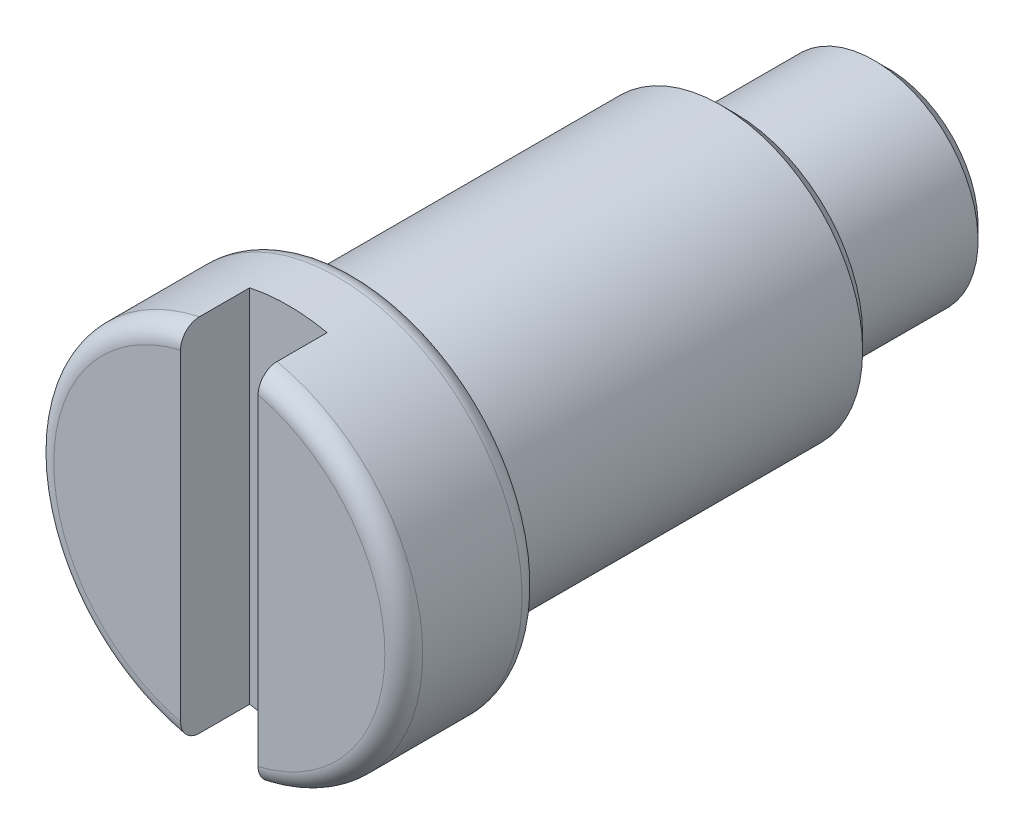
ISO-10303-21;
HEADER;
FILE_DESCRIPTION(('STEP AP214'),'2;1');
FILE_NAME('part.step','',(''),(''),'','','');
FILE_SCHEMA(('AUTOMOTIVE_DESIGN { 1 0 10303 214 1 1 1 1 }'));
ENDSEC;
DATA;
#1=APPLICATION_CONTEXT('core data for automotive mechanical design processes');
#2=APPLICATION_PROTOCOL_DEFINITION('international standard','automotive_design',2000,#1);
#3=PRODUCT_CONTEXT('',#1,'mechanical');
#4=PRODUCT('Part','Part','',(#3));
#5=PRODUCT_RELATED_PRODUCT_CATEGORY('part','',(#4));
#6=PRODUCT_DEFINITION_FORMATION('','',#4);
#7=PRODUCT_DEFINITION_CONTEXT('part definition',#1,'design');
#8=PRODUCT_DEFINITION('design','',#6,#7);
#9=PRODUCT_DEFINITION_SHAPE('','',#8);
#10=(LENGTH_UNIT() NAMED_UNIT(*) SI_UNIT(.MILLI.,.METRE.));
#11=(NAMED_UNIT(*) PLANE_ANGLE_UNIT() SI_UNIT($,.RADIAN.));
#12=(NAMED_UNIT(*) SI_UNIT($,.STERADIAN.) SOLID_ANGLE_UNIT());
#13=UNCERTAINTY_MEASURE_WITH_UNIT(LENGTH_MEASURE(1.E-05),#10,'distance_accuracy_value','');
#14=(GEOMETRIC_REPRESENTATION_CONTEXT(3) GLOBAL_UNCERTAINTY_ASSIGNED_CONTEXT((#13)) GLOBAL_UNIT_ASSIGNED_CONTEXT((#10,
#11,#12)) REPRESENTATION_CONTEXT('',''));
#15=CARTESIAN_POINT('',(0.,0.,0.));
#16=DIRECTION('',(0.,0.,1.));
#17=DIRECTION('',(1.,0.,0.));
#18=AXIS2_PLACEMENT_3D('',#15,#16,#17);
#19=CARTESIAN_POINT('',(-0.41,-8.96687794051,-0.73));
#20=DIRECTION('',(0.,0.,1.));
#21=DIRECTION('',(1.,0.,0.));
#22=AXIS2_PLACEMENT_3D('',#19,#20,#21);
#23=PLANE('',#22);
#24=CARTESIAN_POINT('',(0.,0.,-0.73));
#25=DIRECTION('',(0.,0.,-1.));
#26=DIRECTION('',(-1.,0.,0.));
#27=AXIS2_PLACEMENT_3D('',#24,#25,#26);
#28=CIRCLE('',#27,1.95);
#29=CARTESIAN_POINT('',(0.41,1.9064102391754,-0.73));
#30=VERTEX_POINT('',#29);
#31=CARTESIAN_POINT('',(-0.41,1.9064102391669,-0.73));
#32=VERTEX_POINT('',#31);
#33=EDGE_CURVE('E80',#30,#32,#28,.F.);
#34=ORIENTED_EDGE('',*,*,#33,.T.);
#35=DIRECTION('',(0.,1.,0.));
#36=VECTOR('',#35,1.);
#37=CARTESIAN_POINT('',(-0.41,-8.96687794051,-0.73));
#38=LINE('',#37,#36);
#39=CARTESIAN_POINT('',(-0.41,-1.9064102391669,-0.73));
#40=VERTEX_POINT('',#39);
#41=EDGE_CURVE('E82',#40,#32,#38,.T.);
#42=ORIENTED_EDGE('',*,*,#41,.F.);
#43=CARTESIAN_POINT('',(0.,0.,-0.73));
#44=DIRECTION('',(0.,0.,-1.));
#45=DIRECTION('',(-1.,0.,0.));
#46=AXIS2_PLACEMENT_3D('',#43,#44,#45);
#47=CIRCLE('',#46,1.95);
#48=CARTESIAN_POINT('',(0.41,-1.9064102391669,-0.73));
#49=VERTEX_POINT('',#48);
#50=EDGE_CURVE('E20',#40,#49,#47,.F.);
#51=ORIENTED_EDGE('',*,*,#50,.T.);
#52=DIRECTION('',(0.,1.,0.));
#53=VECTOR('',#52,1.);
#54=CARTESIAN_POINT('',(0.41,-8.96687794051,-0.73));
#55=LINE('',#54,#53);
#56=EDGE_CURVE('E89',#30,#49,#55,.F.);
#57=ORIENTED_EDGE('',*,*,#56,.F.);
#58=EDGE_LOOP('',(#34,#42,#51,#57));
#59=FACE_BOUND('',#58,.T.);
#60=ADVANCED_FACE('F17',(#59),#23,.T.);
#61=CARTESIAN_POINT('',(0.41,-8.96687794051,-0.73));
#62=DIRECTION('',(-1.,0.,0.));
#63=DIRECTION('',(0.,0.,1.));
#64=AXIS2_PLACEMENT_3D('',#61,#62,#63);
#65=PLANE('',#64);
#66=DIRECTION('',(0.,0.,1.));
#67=VECTOR('',#66,1.);
#68=CARTESIAN_POINT('',(0.41,1.906410239184,-0.73));
#69=LINE('',#68,#67);
#70=CARTESIAN_POINT('',(0.41,1.9064102391754,-0.199999999997));
#71=VERTEX_POINT('',#70);
#72=EDGE_CURVE('E91',#71,#30,#69,.F.);
#73=ORIENTED_EDGE('',*,*,#72,.T.);
#74=ORIENTED_EDGE('',*,*,#56,.T.);
#75=DIRECTION('',(0.,0.,1.));
#76=VECTOR('',#75,1.);
#77=CARTESIAN_POINT('',(0.41,-1.906410239167,-0.73));
#78=LINE('',#77,#76);
#79=CARTESIAN_POINT('',(0.409999999999999,-1.9064102391669,-0.1999999999982));
#80=VERTEX_POINT('',#79);
#81=EDGE_CURVE('E76',#49,#80,#78,.T.);
#82=ORIENTED_EDGE('',*,*,#81,.T.);
#83=CARTESIAN_POINT('',(0.409999999999999,-1.9064102391668,-0.1999999999994));
#84=CARTESIAN_POINT('',(0.410000000000001,-1.90642073201662,-0.188935909425886));
#85=CARTESIAN_POINT('',(0.41,-1.90547181301739,-0.17787601446626));
#86=CARTESIAN_POINT('',(0.409999999999999,-1.90173416208713,-0.156086634893258));
#87=CARTESIAN_POINT('',(0.409999999999998,-1.89894796519605,-0.14535671630541));
#88=CARTESIAN_POINT('',(0.409999999999998,-1.89161334067293,-0.12451421506964));
#89=CARTESIAN_POINT('',(0.409999999999999,-1.88706441660261,-0.11440180726134));
#90=CARTESIAN_POINT('',(0.41,-1.87634918228616,-0.095075278442462));
#91=CARTESIAN_POINT('',(0.409999999999999,-1.87018289207332,-0.0858611463074552));
#92=CARTESIAN_POINT('',(0.409999999999999,-1.85635504906559,-0.0684963080743695));
#93=CARTESIAN_POINT('',(0.41,-1.84868044255964,-0.0603560043149509));
#94=CARTESIAN_POINT('',(0.409999999999999,-1.83209823806731,-0.0454459635773487));
#95=CARTESIAN_POINT('',(0.409999999999998,-1.82319043083293,-0.0386764596758893));
#96=CARTESIAN_POINT('',(0.409999999999998,-1.80419297936883,-0.0265439694319283));
#97=CARTESIAN_POINT('',(0.409999999999999,-1.79408202654268,-0.0212143879963644));
#98=CARTESIAN_POINT('',(0.41,-1.77312406597645,-0.012284540769646));
#99=CARTESIAN_POINT('',(0.409999999999999,-1.76227719565737,-0.00868395312492724));
#100=CARTESIAN_POINT('',(0.409999999999999,-1.74304683526872,-0.00399599964380329));
#101=CARTESIAN_POINT('',(0.409999999999999,-1.73476082665802,-0.00249765790653519));
#102=CARTESIAN_POINT('',(0.41,-1.71808183905436,-0.000499679376716791));
#103=CARTESIAN_POINT('',(0.410000000000001,-1.70968903928075,1.45300888987605E-06));
#104=CARTESIAN_POINT('',(0.410000000000001,-1.70129362545099,0.));
#105=B_SPLINE_CURVE_WITH_KNOTS('',3,(#83,#84,#85,#86,#87,#88,#89,#90,#91,#92,#93,#94,#95,#96,
#97,#98,#99,#100,#101,#102,#103,#104),.UNSPECIFIED.,.F.,.F.,(4,2,2,2,2,2,2,2,2,2,4),(0.,
0.0331453845891454,0.0662451312529841,0.0993542066082952,0.132462871881988,0.165871807589145,
0.199286419047546,0.233420144854118,0.267547514175047,0.292751405910464,0.317917468817511),.UNSPECIFIED.);
#106=CARTESIAN_POINT('',(0.41,-1.701293625451,0.));
#107=VERTEX_POINT('',#106);
#108=EDGE_CURVE('E99',#80,#107,#105,.T.);
#109=ORIENTED_EDGE('',*,*,#108,.T.);
#110=DIRECTION('',(0.,1.,0.));
#111=VECTOR('',#110,1.);
#112=CARTESIAN_POINT('',(0.41,0.,0.));
#113=LINE('',#112,#111);
#114=CARTESIAN_POINT('',(0.41,1.701293625451,0.));
#115=VERTEX_POINT('',#114);
#116=EDGE_CURVE('E119',#107,#115,#113,.T.);
#117=ORIENTED_EDGE('',*,*,#116,.T.);
#118=CARTESIAN_POINT('',(0.409999999999999,1.701293625451,0.));
#119=CARTESIAN_POINT('',(0.410000000002229,1.71306590904861,8.78214871465354E-06));
#120=CARTESIAN_POINT('',(0.410000000001304,1.7248381977497,-0.000981901612816971));
#121=CARTESIAN_POINT('',(0.409999999998695,1.74805561338932,-0.00490756838201299));
#122=CARTESIAN_POINT('',(0.409999999997009,1.75950069623836,-0.00784281213418027));
#123=CARTESIAN_POINT('',(0.409999999998427,1.78174299074401,-0.0156063587050561));
#124=CARTESIAN_POINT('',(0.410000000001535,1.79253962254991,-0.0204363275759226));
#125=CARTESIAN_POINT('',(0.409999999998465,1.81314685306385,-0.0318657093925813));
#126=CARTESIAN_POINT('',(0.409999999992293,1.82295790720166,-0.0384642998495639));
#127=CARTESIAN_POINT('',(0.409999999993566,1.84115406576136,-0.0531454088814542));
#128=CARTESIAN_POINT('',(0.410000000000806,1.84955854059986,-0.0612039028652662));
#129=CARTESIAN_POINT('',(0.409999999999194,1.86485290917502,-0.0786481254288913));
#130=CARTESIAN_POINT('',(0.409999999990345,1.87174315662201,-0.0880335432073086));
#131=CARTESIAN_POINT('',(0.409999999989569,1.88363996534004,-0.107622254778722));
#132=CARTESIAN_POINT('',(0.409999999997243,1.88868763260167,-0.117800622631082));
#133=CARTESIAN_POINT('',(0.410000000002754,1.89695967352409,-0.138868589182004));
#134=CARTESIAN_POINT('',(0.410000000000601,1.90018573741462,-0.149757518062343));
#135=CARTESIAN_POINT('',(0.40999999999965,1.90376613264431,-0.167279422370648));
#136=CARTESIAN_POINT('',(0.409999999999825,1.90475718075972,-0.173788735975535));
#137=CARTESIAN_POINT('',(0.410000000000174,1.90607898727918,-0.186864323551235));
#138=CARTESIAN_POINT('',(0.410000000000346,1.90641071913279,-0.193430499149179));
#139=CARTESIAN_POINT('',(0.409999999999992,1.9064102391668,-0.199999999998196));
#140=B_SPLINE_CURVE_WITH_KNOTS('',3,(#118,#119,#120,#121,#122,#123,#124,#125,#126,#127,#128,
#129,#130,#131,#132,#133,#134,#135,#136,#137,#138,#139),.UNSPECIFIED.,.F.,.F.,(4,2,2,2,2,2,2,2,
2,2,4),(0.,0.0352756157378741,0.0705559625126531,0.105867401464157,0.141162447410486,
0.175922174914147,0.210673774197639,0.244594325750203,0.278483351153767,0.298206112665351,
0.317899732747287),.UNSPECIFIED.);
#141=EDGE_CURVE('E98',#115,#71,#140,.T.);
#142=ORIENTED_EDGE('',*,*,#141,.T.);
#143=EDGE_LOOP('',(#73,#74,#82,#109,#117,#142));
#144=FACE_BOUND('',#143,.T.);
#145=ADVANCED_FACE('F387',(#144),#65,.T.);
#146=CARTESIAN_POINT('',(-0.41,-8.96687794051,0.));
#147=DIRECTION('',(1.,0.,0.));
#148=DIRECTION('',(0.,0.,-1.));
#149=AXIS2_PLACEMENT_3D('',#146,#147,#148);
#150=PLANE('',#149);
#151=DIRECTION('',(0.,1.,0.));
#152=VECTOR('',#151,1.);
#153=CARTESIAN_POINT('',(-0.41,0.,0.));
#154=LINE('',#153,#152);
#155=CARTESIAN_POINT('',(-0.41,1.701293625451,0.));
#156=VERTEX_POINT('',#155);
#157=CARTESIAN_POINT('',(-0.41,-1.701293625451,0.));
#158=VERTEX_POINT('',#157);
#159=EDGE_CURVE('E117',#156,#158,#154,.F.);
#160=ORIENTED_EDGE('',*,*,#159,.T.);
#161=CARTESIAN_POINT('',(-0.41,-1.701293625451,0.));
#162=CARTESIAN_POINT('',(-0.41000000000223,-1.71306590904861,8.78214871464386E-06));
#163=CARTESIAN_POINT('',(-0.410000000001305,-1.7248381977497,-0.000981901612817001));
#164=CARTESIAN_POINT('',(-0.409999999998695,-1.74805561338932,-0.00490756838201304));
#165=CARTESIAN_POINT('',(-0.409999999997009,-1.75950069623836,-0.00784281213418028));
#166=CARTESIAN_POINT('',(-0.409999999998427,-1.78174299074401,-0.015606358705056));
#167=CARTESIAN_POINT('',(-0.410000000001535,-1.79253962254991,-0.0204363275759224));
#168=CARTESIAN_POINT('',(-0.409999999998466,-1.81314685306385,-0.0318657093925812));
#169=CARTESIAN_POINT('',(-0.409999999992294,-1.82295790720166,-0.038464299849564));
#170=CARTESIAN_POINT('',(-0.409999999993567,-1.84115406576136,-0.0531454088814543));
#171=CARTESIAN_POINT('',(-0.410000000000806,-1.84955854059986,-0.0612039028652663));
#172=CARTESIAN_POINT('',(-0.409999999999194,-1.86485290917502,-0.0786481254288913));
#173=CARTESIAN_POINT('',(-0.409999999990345,-1.87174315662201,-0.0880335432073086));
#174=CARTESIAN_POINT('',(-0.40999999998957,-1.88363996534004,-0.107622254778722));
#175=CARTESIAN_POINT('',(-0.409999999997244,-1.88868763260167,-0.117800622631081));
#176=CARTESIAN_POINT('',(-0.410000000002754,-1.89695967352409,-0.138868589182003));
#177=CARTESIAN_POINT('',(-0.410000000000599,-1.90018573741462,-0.149757518062343));
#178=CARTESIAN_POINT('',(-0.409999999999648,-1.90376613264437,-0.167279422370942));
#179=CARTESIAN_POINT('',(-0.409999999999825,-1.90475718075981,-0.173788735976129));
#180=CARTESIAN_POINT('',(-0.410000000000175,-1.90607898727927,-0.186864323552431));
#181=CARTESIAN_POINT('',(-0.410000000000348,-1.90641071913285,-0.193430499150679));
#182=CARTESIAN_POINT('',(-0.409999999999993,-1.9064102391668,-0.199999999999996));
#183=B_SPLINE_CURVE_WITH_KNOTS('',3,(#161,#162,#163,#164,#165,#166,#167,#168,#169,#170,#171,
#172,#173,#174,#175,#176,#177,#178,#179,#180,#181,#182),.UNSPECIFIED.,.F.,.F.,(4,2,2,2,2,2,2,2,
2,2,4),(0.,0.0352756157378745,0.0705559625126533,0.105867401464157,0.141162447410486,
0.175922174914147,0.210673774197639,0.244594325750202,0.278483351153768,0.29820611266625,
0.317899732749085),.UNSPECIFIED.);
#184=CARTESIAN_POINT('',(-0.41,-1.9064102391669,-0.2));
#185=VERTEX_POINT('',#184);
#186=EDGE_CURVE('E35',#158,#185,#183,.T.);
#187=ORIENTED_EDGE('',*,*,#186,.T.);
#188=DIRECTION('',(0.,0.,-1.));
#189=VECTOR('',#188,1.);
#190=CARTESIAN_POINT('',(-0.41,-1.906410239167,0.));
#191=LINE('',#190,#189);
#192=EDGE_CURVE('E73',#185,#40,#191,.T.);
#193=ORIENTED_EDGE('',*,*,#192,.T.);
#194=ORIENTED_EDGE('',*,*,#41,.T.);
#195=DIRECTION('',(0.,0.,-1.));
#196=VECTOR('',#195,1.);
#197=CARTESIAN_POINT('',(-0.41,1.906410239167,0.));
#198=LINE('',#197,#196);
#199=CARTESIAN_POINT('',(-0.41,1.9064102391669,-0.2));
#200=VERTEX_POINT('',#199);
#201=EDGE_CURVE('E86',#32,#200,#198,.F.);
#202=ORIENTED_EDGE('',*,*,#201,.T.);
#203=CARTESIAN_POINT('',(-0.41,1.9064102391668,-0.2));
#204=CARTESIAN_POINT('',(-0.41,1.90642073201665,-0.188935909426487));
#205=CARTESIAN_POINT('',(-0.41,1.90547181301746,-0.177876014466859));
#206=CARTESIAN_POINT('',(-0.41,1.90173416208727,-0.156086634893848));
#207=CARTESIAN_POINT('',(-0.41,1.89894796519622,-0.145356716305992));
#208=CARTESIAN_POINT('',(-0.41,1.89161334067317,-0.124514215070201));
#209=CARTESIAN_POINT('',(-0.41,1.88706441660288,-0.114401807261888));
#210=CARTESIAN_POINT('',(-0.41,1.87634918228649,-0.0950752784429788));
#211=CARTESIAN_POINT('',(-0.409999999999999,1.87018289207367,-0.085861146307954));
#212=CARTESIAN_POINT('',(-0.41,1.856355049066,-0.0684963080748281));
#213=CARTESIAN_POINT('',(-0.41,1.84868044256008,-0.0603560043153873));
#214=CARTESIAN_POINT('',(-0.41,1.83209823806779,-0.045445963577737));
#215=CARTESIAN_POINT('',(-0.41,1.82319043083343,-0.0386764596762518));
#216=CARTESIAN_POINT('',(-0.409999999999999,1.80419297936938,-0.0265439694322356));
#217=CARTESIAN_POINT('',(-0.41,1.79408202654325,-0.0212143879966421));
#218=CARTESIAN_POINT('',(-0.41,1.77312406597704,-0.012284540769862));
#219=CARTESIAN_POINT('',(-0.41,1.76227719565798,-0.00868395312511121));
#220=CARTESIAN_POINT('',(-0.41,1.74304683526924,-0.00399599964390427));
#221=CARTESIAN_POINT('',(-0.41,1.73476082665844,-0.00249765790659835));
#222=CARTESIAN_POINT('',(-0.41,1.71808183905457,-0.000499679376729377));
#223=CARTESIAN_POINT('',(-0.41,1.70968903928086,1.45300889005112E-06));
#224=CARTESIAN_POINT('',(-0.410000000000001,1.70129362545099,0.));
#225=B_SPLINE_CURVE_WITH_KNOTS('',3,(#203,#204,#205,#206,#207,#208,#209,#210,#211,#212,#213,
#214,#215,#216,#217,#218,#219,#220,#221,#222,#223,#224),.UNSPECIFIED.,.F.,.F.,(4,2,2,2,2,2,2,2,
2,2,4),(0.,0.0331453845891425,0.0662451312529782,0.0993542066082864,0.132462871881977,
0.165871807589129,0.199286419047523,0.233420144854088,0.26754751417501,0.292751405910745,
0.31791746881811),.UNSPECIFIED.);
#226=EDGE_CURVE('E120',#200,#156,#225,.T.);
#227=ORIENTED_EDGE('',*,*,#226,.T.);
#228=EDGE_LOOP('',(#160,#187,#193,#194,#202,#227));
#229=FACE_BOUND('',#228,.T.);
#230=ADVANCED_FACE('F88',(#229),#150,.T.);
#231=CARTESIAN_POINT('',(0.,0.,-7.07));
#232=DIRECTION('',(0.,0.,-1.));
#233=DIRECTION('',(-1.,0.,0.));
#234=AXIS2_PLACEMENT_3D('',#231,#232,#233);
#235=PLANE('',#234);
#236=CARTESIAN_POINT('',(0.,0.,-7.06999999994196));
#237=DIRECTION('',(0.,0.,1.));
#238=DIRECTION('',(0.,-1.,0.));
#239=AXIS2_PLACEMENT_3D('',#236,#237,#238);
#240=CIRCLE('',#239,0.950000000045748);
#241=CARTESIAN_POINT('',(0.,-0.950000000045747,-7.06999999994196));
#242=VERTEX_POINT('',#241);
#243=EDGE_CURVE('E113',#242,#242,#240,.T.);
#244=ORIENTED_EDGE('',*,*,#243,.F.);
#245=EDGE_LOOP('',(#244));
#246=FACE_BOUND('',#245,.T.);
#247=ADVANCED_FACE('F176',(#246),#235,.T.);
#248=CARTESIAN_POINT('',(0.,0.,0.));
#249=DIRECTION('',(0.,0.,-1.));
#250=DIRECTION('',(-1.,0.,0.));
#251=AXIS2_PLACEMENT_3D('',#248,#249,#250);
#252=PLANE('',#251);
#253=ORIENTED_EDGE('',*,*,#116,.F.);
#254=CARTESIAN_POINT('',(0.,0.,0.));
#255=DIRECTION('',(0.,0.,-1.));
#256=DIRECTION('',(0.234285714285706,0.972167785971967,0.));
#257=AXIS2_PLACEMENT_3D('',#254,#255,#256);
#258=CIRCLE('',#257,1.75000000000006);
#259=EDGE_CURVE('E116',#115,#107,#258,.T.);
#260=ORIENTED_EDGE('',*,*,#259,.F.);
#261=EDGE_LOOP('',(#253,#260));
#262=FACE_BOUND('',#261,.T.);
#263=ADVANCED_FACE('F173',(#262),#252,.F.);
#264=CARTESIAN_POINT('',(0.,0.,0.));
#265=DIRECTION('',(0.,0.,-1.));
#266=DIRECTION('',(-1.,0.,0.));
#267=AXIS2_PLACEMENT_3D('',#264,#265,#266);
#268=PLANE('',#267);
#269=CARTESIAN_POINT('',(0.,0.,0.));
#270=DIRECTION('',(0.,0.,-1.));
#271=DIRECTION('',(-0.234285714285706,-0.972167785971967,0.));
#272=AXIS2_PLACEMENT_3D('',#269,#270,#271);
#273=CIRCLE('',#272,1.75000000000006);
#274=EDGE_CURVE('E157',#158,#156,#273,.T.);
#275=ORIENTED_EDGE('',*,*,#274,.F.);
#276=ORIENTED_EDGE('',*,*,#159,.F.);
#277=EDGE_LOOP('',(#275,#276));
#278=FACE_BOUND('',#277,.T.);
#279=ADVANCED_FACE('F163',(#278),#268,.F.);
#280=CARTESIAN_POINT('',(0.,0.,-6.91999999997961));
#281=DIRECTION('',(0.,0.,1.));
#282=DIRECTION('',(0.,-1.,0.));
#283=AXIS2_PLACEMENT_3D('',#280,#281,#282);
#284=CONICAL_SURFACE('',#283,1.10000000000809,0.785398163397448);
#285=ORIENTED_EDGE('',*,*,#243,.T.);
#286=EDGE_LOOP('',(#285));
#287=FACE_BOUND('',#286,.T.);
#288=CARTESIAN_POINT('',(0.,0.,-6.92));
#289=DIRECTION('',(0.,0.,-1.));
#290=DIRECTION('',(-1.,0.,0.));
#291=AXIS2_PLACEMENT_3D('',#288,#289,#290);
#292=CIRCLE('',#291,1.1);
#293=CARTESIAN_POINT('',(-1.1,0.,-6.92));
#294=VERTEX_POINT('',#293);
#295=EDGE_CURVE('E112',#294,#294,#292,.F.);
#296=ORIENTED_EDGE('',*,*,#295,.F.);
#297=EDGE_LOOP('',(#296));
#298=FACE_BOUND('',#297,.T.);
#299=ADVANCED_FACE('F172',(#287,#298),#284,.T.);
#300=CARTESIAN_POINT('',(0.,0.,-0.2));
#301=DIRECTION('',(0.,0.,-1.));
#302=DIRECTION('',(-1.,0.,0.));
#303=AXIS2_PLACEMENT_3D('',#300,#301,#302);
#304=TOROIDAL_SURFACE('',#303,1.75,0.2);
#305=ORIENTED_EDGE('',*,*,#108,.F.);
#306=CARTESIAN_POINT('',(0.,0.,-0.199999999997));
#307=DIRECTION('',(0.,0.,-1.));
#308=DIRECTION('',(-1.,0.,0.));
#309=AXIS2_PLACEMENT_3D('',#306,#307,#308);
#310=CIRCLE('',#309,1.95);
#311=EDGE_CURVE('E110',#71,#80,#310,.T.);
#312=ORIENTED_EDGE('',*,*,#311,.F.);
#313=ORIENTED_EDGE('',*,*,#141,.F.);
#314=ORIENTED_EDGE('',*,*,#259,.T.);
#315=EDGE_LOOP('',(#305,#312,#313,#314));
#316=FACE_BOUND('',#315,.T.);
#317=ADVANCED_FACE('F139',(#316),#304,.T.);
#318=CARTESIAN_POINT('',(0.,0.,-0.2));
#319=DIRECTION('',(0.,0.,-1.));
#320=DIRECTION('',(-1.,0.,0.));
#321=AXIS2_PLACEMENT_3D('',#318,#319,#320);
#322=TOROIDAL_SURFACE('',#321,1.75,0.2);
#323=ORIENTED_EDGE('',*,*,#186,.F.);
#324=ORIENTED_EDGE('',*,*,#274,.T.);
#325=ORIENTED_EDGE('',*,*,#226,.F.);
#326=CARTESIAN_POINT('',(0.,0.,-0.2));
#327=DIRECTION('',(0.,0.,-1.));
#328=DIRECTION('',(-1.,0.,0.));
#329=AXIS2_PLACEMENT_3D('',#326,#327,#328);
#330=CIRCLE('',#329,1.95);
#331=EDGE_CURVE('E109',#185,#200,#330,.T.);
#332=ORIENTED_EDGE('',*,*,#331,.F.);
#333=EDGE_LOOP('',(#323,#324,#325,#332));
#334=FACE_BOUND('',#333,.T.);
#335=ADVANCED_FACE('F132',(#334),#322,.T.);
#336=CARTESIAN_POINT('',(0.,0.,-14.42646313088));
#337=DIRECTION('',(0.,0.,-1.));
#338=DIRECTION('',(-1.,0.,0.));
#339=AXIS2_PLACEMENT_3D('',#336,#337,#338);
#340=CYLINDRICAL_SURFACE('',#339,1.1);
#341=CARTESIAN_POINT('',(0.,0.,-5.45));
#342=DIRECTION('',(0.,0.,-1.));
#343=DIRECTION('',(-1.,0.,0.));
#344=AXIS2_PLACEMENT_3D('',#341,#342,#343);
#345=CIRCLE('',#344,1.1);
#346=CARTESIAN_POINT('',(-1.1,0.,-5.45));
#347=VERTEX_POINT('',#346);
#348=EDGE_CURVE('E106',#347,#347,#345,.T.);
#349=ORIENTED_EDGE('',*,*,#348,.T.);
#350=EDGE_LOOP('',(#349));
#351=FACE_BOUND('',#350,.T.);
#352=ORIENTED_EDGE('',*,*,#295,.T.);
#353=EDGE_LOOP('',(#352));
#354=FACE_BOUND('',#353,.T.);
#355=ADVANCED_FACE('F138',(#351,#354),#340,.T.);
#356=CARTESIAN_POINT('',(0.,0.,-1.45));
#357=DIRECTION('',(0.,0.,-1.));
#358=DIRECTION('',(-1.,0.,0.));
#359=AXIS2_PLACEMENT_3D('',#356,#357,#358);
#360=CYLINDRICAL_SURFACE('',#359,1.95);
#361=ORIENTED_EDGE('',*,*,#33,.F.);
#362=ORIENTED_EDGE('',*,*,#72,.F.);
#363=ORIENTED_EDGE('',*,*,#311,.T.);
#364=ORIENTED_EDGE('',*,*,#81,.F.);
#365=ORIENTED_EDGE('',*,*,#50,.F.);
#366=ORIENTED_EDGE('',*,*,#192,.F.);
#367=ORIENTED_EDGE('',*,*,#331,.T.);
#368=ORIENTED_EDGE('',*,*,#201,.F.);
#369=EDGE_LOOP('',(#361,#362,#363,#364,#365,#366,#367,#368));
#370=FACE_BOUND('',#369,.T.);
#371=CARTESIAN_POINT('',(0.,0.,-1.25));
#372=DIRECTION('',(0.,0.,-1.));
#373=DIRECTION('',(-1.,0.,0.));
#374=AXIS2_PLACEMENT_3D('',#371,#372,#373);
#375=CIRCLE('',#374,1.95);
#376=CARTESIAN_POINT('',(-1.95,0.,-1.25));
#377=VERTEX_POINT('',#376);
#378=EDGE_CURVE('E105',#377,#377,#375,.T.);
#379=ORIENTED_EDGE('',*,*,#378,.F.);
#380=EDGE_LOOP('',(#379));
#381=FACE_BOUND('',#380,.T.);
#382=ADVANCED_FACE('F69',(#370,#381),#360,.T.);
#383=CARTESIAN_POINT('',(0.,0.,-5.45));
#384=DIRECTION('',(0.,0.,1.));
#385=DIRECTION('',(1.,0.,0.));
#386=AXIS2_PLACEMENT_3D('',#383,#384,#385);
#387=PLANE('',#386);
#388=ORIENTED_EDGE('',*,*,#348,.F.);
#389=EDGE_LOOP('',(#388));
#390=FACE_BOUND('',#389,.T.);
#391=CARTESIAN_POINT('',(0.,0.,-5.44999999999618));
#392=DIRECTION('',(0.,0.,1.));
#393=DIRECTION('',(1.,0.,0.));
#394=AXIS2_PLACEMENT_3D('',#391,#392,#393);
#395=CIRCLE('',#394,1.35000000000218);
#396=CARTESIAN_POINT('',(1.35000000000218,0.,-5.44999999999618));
#397=VERTEX_POINT('',#396);
#398=EDGE_CURVE('E101',#397,#397,#395,.T.);
#399=ORIENTED_EDGE('',*,*,#398,.F.);
#400=EDGE_LOOP('',(#399));
#401=FACE_BOUND('',#400,.T.);
#402=ADVANCED_FACE('F229',(#390,#401),#387,.F.);
#403=CARTESIAN_POINT('',(0.,0.,-1.25));
#404=DIRECTION('',(0.,0.,-1.));
#405=DIRECTION('',(-1.,0.,0.));
#406=AXIS2_PLACEMENT_3D('',#403,#404,#405);
#407=TOROIDAL_SURFACE('',#406,1.75,0.2);
#408=CARTESIAN_POINT('',(0.,0.,-1.45));
#409=DIRECTION('',(0.,0.,1.));
#410=DIRECTION('',(-1.,0.,0.));
#411=AXIS2_PLACEMENT_3D('',#408,#409,#410);
#412=CIRCLE('',#411,1.75);
#413=CARTESIAN_POINT('',(-1.75,0.,-1.45));
#414=VERTEX_POINT('',#413);
#415=EDGE_CURVE('E104',#414,#414,#412,.F.);
#416=ORIENTED_EDGE('',*,*,#415,.F.);
#417=EDGE_LOOP('',(#416));
#418=FACE_BOUND('',#417,.T.);
#419=ORIENTED_EDGE('',*,*,#378,.T.);
#420=EDGE_LOOP('',(#419));
#421=FACE_BOUND('',#420,.T.);
#422=ADVANCED_FACE('F217',(#418,#421),#407,.T.);
#423=CARTESIAN_POINT('',(0.,0.,-5.30000000009068));
#424=DIRECTION('',(0.,0.,1.));
#425=DIRECTION('',(1.,0.,0.));
#426=AXIS2_PLACEMENT_3D('',#423,#424,#425);
#427=CONICAL_SURFACE('',#426,1.49999999990769,0.785398163397448);
#428=CARTESIAN_POINT('',(0.,0.,-5.3));
#429=DIRECTION('',(0.,0.,-1.));
#430=DIRECTION('',(-1.,0.,0.));
#431=AXIS2_PLACEMENT_3D('',#428,#429,#430);
#432=CIRCLE('',#431,1.5);
#433=CARTESIAN_POINT('',(-1.5,0.,-5.3));
#434=VERTEX_POINT('',#433);
#435=EDGE_CURVE('E26',#434,#434,#432,.F.);
#436=ORIENTED_EDGE('',*,*,#435,.F.);
#437=EDGE_LOOP('',(#436));
#438=FACE_BOUND('',#437,.T.);
#439=ORIENTED_EDGE('',*,*,#398,.T.);
#440=EDGE_LOOP('',(#439));
#441=FACE_BOUND('',#440,.T.);
#442=ADVANCED_FACE('F228',(#438,#441),#427,.T.);
#443=CARTESIAN_POINT('',(0.,0.,-1.45));
#444=DIRECTION('',(0.,0.,-1.));
#445=DIRECTION('',(-1.,0.,0.));
#446=AXIS2_PLACEMENT_3D('',#443,#444,#445);
#447=PLANE('',#446);
#448=CARTESIAN_POINT('',(0.,0.,-1.45));
#449=DIRECTION('',(0.,0.,-1.));
#450=DIRECTION('',(-1.,0.,0.));
#451=AXIS2_PLACEMENT_3D('',#448,#449,#450);
#452=CIRCLE('',#451,1.5);
#453=CARTESIAN_POINT('',(-1.5,0.,-1.45));
#454=VERTEX_POINT('',#453);
#455=EDGE_CURVE('E11',#454,#454,#452,.T.);
#456=ORIENTED_EDGE('',*,*,#455,.F.);
#457=EDGE_LOOP('',(#456));
#458=FACE_BOUND('',#457,.T.);
#459=ORIENTED_EDGE('',*,*,#415,.T.);
#460=EDGE_LOOP('',(#459));
#461=FACE_BOUND('',#460,.T.);
#462=ADVANCED_FACE('F250',(#458,#461),#447,.T.);
#463=CARTESIAN_POINT('',(0.,0.,-7.07));
#464=DIRECTION('',(0.,0.,-1.));
#465=DIRECTION('',(-1.,0.,0.));
#466=AXIS2_PLACEMENT_3D('',#463,#464,#465);
#467=CYLINDRICAL_SURFACE('',#466,1.5);
#468=ORIENTED_EDGE('',*,*,#455,.T.);
#469=EDGE_LOOP('',(#468));
#470=FACE_BOUND('',#469,.T.);
#471=ORIENTED_EDGE('',*,*,#435,.T.);
#472=EDGE_LOOP('',(#471));
#473=FACE_BOUND('',#472,.T.);
#474=ADVANCED_FACE('F248',(#470,#473),#467,.T.);
#475=CLOSED_SHELL('',(#60,#145,#230,#247,#263,#279,#299,#317,#335,#355,#382,#402,#422,#442,#462,#474));
#476=MANIFOLD_SOLID_BREP('B1',#475);
#477=ADVANCED_BREP_SHAPE_REPRESENTATION('',(#18,#476),#14);
#478=SHAPE_DEFINITION_REPRESENTATION(#9,#477);
ENDSEC;
END-ISO-10303-21;
